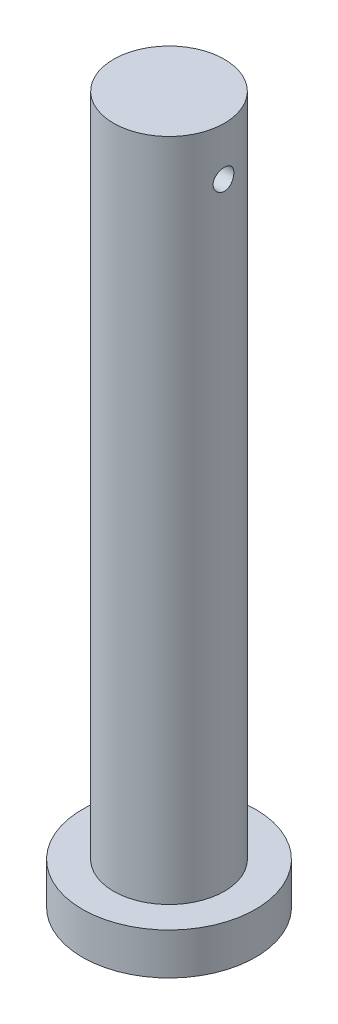
ISO-10303-21;
HEADER;
FILE_DESCRIPTION(('STEP AP214'),'2;1');
FILE_NAME('part.step','',(''),(''),'','','');
FILE_SCHEMA(('AUTOMOTIVE_DESIGN { 1 0 10303 214 1 1 1 1 }'));
ENDSEC;
DATA;
#1=APPLICATION_CONTEXT('core data for automotive mechanical design processes');
#2=APPLICATION_PROTOCOL_DEFINITION('international standard','automotive_design',2000,#1);
#3=PRODUCT_CONTEXT('',#1,'mechanical');
#4=PRODUCT('Part','Part','',(#3));
#5=PRODUCT_RELATED_PRODUCT_CATEGORY('part','',(#4));
#6=PRODUCT_DEFINITION_FORMATION('','',#4);
#7=PRODUCT_DEFINITION_CONTEXT('part definition',#1,'design');
#8=PRODUCT_DEFINITION('design','',#6,#7);
#9=PRODUCT_DEFINITION_SHAPE('','',#8);
#10=(LENGTH_UNIT() NAMED_UNIT(*) SI_UNIT(.MILLI.,.METRE.));
#11=(NAMED_UNIT(*) PLANE_ANGLE_UNIT() SI_UNIT($,.RADIAN.));
#12=(NAMED_UNIT(*) SI_UNIT($,.STERADIAN.) SOLID_ANGLE_UNIT());
#13=UNCERTAINTY_MEASURE_WITH_UNIT(LENGTH_MEASURE(1.E-05),#10,'distance_accuracy_value','');
#14=(GEOMETRIC_REPRESENTATION_CONTEXT(3) GLOBAL_UNCERTAINTY_ASSIGNED_CONTEXT((#13)) GLOBAL_UNIT_ASSIGNED_CONTEXT((#10,
#11,#12)) REPRESENTATION_CONTEXT('',''));
#15=CARTESIAN_POINT('',(0.,0.,0.));
#16=DIRECTION('',(0.,0.,1.));
#17=DIRECTION('',(1.,0.,0.));
#18=AXIS2_PLACEMENT_3D('',#15,#16,#17);
#19=CARTESIAN_POINT('',(2.41946524128127E-08,-38.0053737553816,9.76190137910418E-08));
#20=DIRECTION('',(0.,-1.,0.));
#21=DIRECTION('',(0.,0.,-1.));
#22=AXIS2_PLACEMENT_3D('',#19,#20,#21);
#23=CYLINDRICAL_SURFACE('',#22,25.);
#24=CARTESIAN_POINT('',(2.41946524128127E-08,-38.0053737553816,9.76190137910418E-08));
#25=DIRECTION('',(0.,1.,0.));
#26=DIRECTION('',(0.,0.,1.));
#27=AXIS2_PLACEMENT_3D('',#24,#25,#26);
#28=CIRCLE('',#27,25.);
#29=CARTESIAN_POINT('',(2.41946524128127E-08,-38.0053737553816,25.000000097619));
#30=VERTEX_POINT('',#29);
#31=EDGE_CURVE('E59',#30,#30,#28,.T.);
#32=ORIENTED_EDGE('',*,*,#31,.F.);
#33=EDGE_LOOP('',(#32));
#34=FACE_BOUND('',#33,.T.);
#35=CARTESIAN_POINT('',(2.41946524128127E-08,-50.0053737553816,9.76190137910418E-08));
#36=DIRECTION('',(0.,1.,0.));
#37=DIRECTION('',(0.,0.,1.));
#38=AXIS2_PLACEMENT_3D('',#35,#36,#37);
#39=CIRCLE('',#38,25.);
#40=CARTESIAN_POINT('',(2.41946524128127E-08,-50.0053737553816,25.000000097619));
#41=VERTEX_POINT('',#40);
#42=EDGE_CURVE('E64',#41,#41,#39,.T.);
#43=ORIENTED_EDGE('',*,*,#42,.T.);
#44=EDGE_LOOP('',(#43));
#45=FACE_BOUND('',#44,.T.);
#46=ADVANCED_FACE('F47',(#34,#45),#23,.T.);
#47=CARTESIAN_POINT('',(2.41946524128127E-08,-38.0053737553816,9.76190137910418E-08));
#48=DIRECTION('',(0.,1.,0.));
#49=DIRECTION('',(0.,0.,1.));
#50=AXIS2_PLACEMENT_3D('',#47,#48,#49);
#51=PLANE('',#50);
#52=CARTESIAN_POINT('',(2.41946524128127E-08,-38.0053737553816,9.76190137910418E-08));
#53=DIRECTION('',(0.,1.,0.));
#54=DIRECTION('',(0.,0.,1.));
#55=AXIS2_PLACEMENT_3D('',#52,#53,#54);
#56=CIRCLE('',#55,16.);
#57=CARTESIAN_POINT('',(2.41946524128127E-08,-38.0053737553816,16.000000097619));
#58=VERTEX_POINT('',#57);
#59=EDGE_CURVE('E10',#58,#58,#56,.T.);
#60=ORIENTED_EDGE('',*,*,#59,.F.);
#61=EDGE_LOOP('',(#60));
#62=FACE_BOUND('',#61,.T.);
#63=ORIENTED_EDGE('',*,*,#31,.T.);
#64=EDGE_LOOP('',(#63));
#65=FACE_BOUND('',#64,.T.);
#66=ADVANCED_FACE('F94',(#62,#65),#51,.T.);
#67=CARTESIAN_POINT('',(2.41946524128127E-08,-50.0053737553816,9.76190137910418E-08));
#68=DIRECTION('',(0.,1.,0.));
#69=DIRECTION('',(0.,0.,1.));
#70=AXIS2_PLACEMENT_3D('',#67,#68,#69);
#71=PLANE('',#70);
#72=ORIENTED_EDGE('',*,*,#42,.F.);
#73=EDGE_LOOP('',(#72));
#74=FACE_BOUND('',#73,.T.);
#75=ADVANCED_FACE('F90',(#74),#71,.F.);
#76=CARTESIAN_POINT('',(2.41946524128127E-08,153.994626244618,9.76190137910418E-08));
#77=DIRECTION('',(0.,-1.,0.));
#78=DIRECTION('',(0.,0.,-1.));
#79=AXIS2_PLACEMENT_3D('',#76,#77,#78);
#80=CYLINDRICAL_SURFACE('',#79,16.);
#81=CARTESIAN_POINT('',(-15.7162336213071,139.994626244618,-2.99999990238099));
#82=CARTESIAN_POINT('',(-15.7162368517067,140.161540660644,-2.99999350004687));
#83=CARTESIAN_POINT('',(-15.7189215710191,140.328538141056,-2.98602242935996));
#84=CARTESIAN_POINT('',(-15.7293569960842,140.657824167782,-2.93054496741683));
#85=CARTESIAN_POINT('',(-15.7371119992672,140.820108597473,-2.88901521775045));
#86=CARTESIAN_POINT('',(-15.7567795051053,141.13515638736,-2.77974061473681));
#87=CARTESIAN_POINT('',(-15.7686881339259,141.287928463233,-2.7120201814685));
#88=CARTESIAN_POINT('',(-15.7953165022239,141.579933363192,-2.5523512175883));
#89=CARTESIAN_POINT('',(-15.8100360223176,141.719167242625,-2.46040457756485));
#90=CARTESIAN_POINT('',(-15.8408322725844,141.981886643017,-2.25367348123344));
#91=CARTESIAN_POINT('',(-15.856922308319,142.105179211562,-2.13864576104283));
#92=CARTESIAN_POINT('',(-15.888529129086,142.330835023818,-1.88954345998809));
#93=CARTESIAN_POINT('',(-15.9040458764284,142.433196893468,-1.75546762963088));
#94=CARTESIAN_POINT('',(-15.9329003323735,142.614824997819,-1.47080769152131));
#95=CARTESIAN_POINT('',(-15.9462205368526,142.693909311657,-1.32010558244871));
#96=CARTESIAN_POINT('',(-15.969032148464,142.825565329166,-1.0072624688825));
#97=CARTESIAN_POINT('',(-15.978523870372,142.878139212599,-0.845122406099986));
#98=CARTESIAN_POINT('',(-15.9925150782809,142.954685341841,-0.51600539475581));
#99=CARTESIAN_POINT('',(-15.9970712953319,142.978982856464,-0.349106548870696));
#100=CARTESIAN_POINT('',(-16.0008736681172,142.999300020019,-0.0135432544517544));
#101=CARTESIAN_POINT('',(-16.0001202760193,142.995322076897,0.155121042514349));
#102=CARTESIAN_POINT('',(-15.9934326510702,142.959450702324,0.487196813417803));
#103=CARTESIAN_POINT('',(-15.9875634207496,142.927907505758,0.650647618521952));
#104=CARTESIAN_POINT('',(-15.9713765024766,142.838354945828,0.969894429049965));
#105=CARTESIAN_POINT('',(-15.9610586524047,142.780344617927,1.12569015527209));
#106=CARTESIAN_POINT('',(-15.9370251817521,142.639170782502,1.42622022912206));
#107=CARTESIAN_POINT('',(-15.9232907276219,142.555867268793,1.57088724129609));
#108=CARTESIAN_POINT('',(-15.8939429266623,142.366574906464,1.8443200520483));
#109=CARTESIAN_POINT('',(-15.8783293888286,142.260583750843,1.97308423144058));
#110=CARTESIAN_POINT('',(-15.8466702494167,142.026994838651,2.21313133555709));
#111=CARTESIAN_POINT('',(-15.8306216938378,141.899090676814,2.32411591275984));
#112=CARTESIAN_POINT('',(-15.8001301542978,141.626327182061,2.52310353464423));
#113=CARTESIAN_POINT('',(-15.7856871938324,141.481467601089,2.61110624304266));
#114=CARTESIAN_POINT('',(-15.7600378419478,141.178509703213,2.76171714210856));
#115=CARTESIAN_POINT('',(-15.7488369864106,141.020389330237,2.82428197052744));
#116=CARTESIAN_POINT('',(-15.7310248237391,140.695623876372,2.92187323712014));
#117=CARTESIAN_POINT('',(-15.7244129965777,140.528979763689,2.95690279564118));
#118=CARTESIAN_POINT('',(-15.7166303818255,140.194587586907,2.9979935506138));
#119=CARTESIAN_POINT('',(-15.7153790921281,140.026894013487,3.00448338333619));
#120=CARTESIAN_POINT('',(-15.7182438042221,139.692819334444,2.9894594752535));
#121=CARTESIAN_POINT('',(-15.7223595405776,139.526438164322,2.96794711934768));
#122=CARTESIAN_POINT('',(-15.7354195770695,139.20112043851,2.89789746153667));
#123=CARTESIAN_POINT('',(-15.7443237096229,139.042133739369,2.8495848692988));
#124=CARTESIAN_POINT('',(-15.7659226589377,138.734511865158,2.72754458520021));
#125=CARTESIAN_POINT('',(-15.778617755071,138.585877453988,2.65381502019491));
#126=CARTESIAN_POINT('',(-15.806551533079,138.301291006532,2.48204716001221));
#127=CARTESIAN_POINT('',(-15.8218178843117,138.165505168886,2.38373809041143));
#128=CARTESIAN_POINT('',(-15.8530962031674,137.91220216419,2.16596698450394));
#129=CARTESIAN_POINT('',(-15.8691082377352,137.794686641507,2.04650304628068));
#130=CARTESIAN_POINT('',(-15.9003324559243,137.57965871755,1.78789893335979));
#131=CARTESIAN_POINT('',(-15.9155310924714,137.482434591407,1.6485171658108));
#132=CARTESIAN_POINT('',(-15.9431880720124,137.312783832263,1.3551491436993));
#133=CARTESIAN_POINT('',(-15.9556465204999,137.240356244568,1.20116345169607));
#134=CARTESIAN_POINT('',(-15.9763611357223,137.12278604889,0.883755180776382));
#135=CARTESIAN_POINT('',(-15.9846390704081,137.077501869496,0.720386523776991));
#136=CARTESIAN_POINT('',(-15.9961528174803,137.015052148039,0.388192552382156));
#137=CARTESIAN_POINT('',(-15.9993891604042,136.997883647293,0.219367814050714));
#138=CARTESIAN_POINT('',(-16.000444526114,136.992255641582,-0.116181422881991));
#139=CARTESIAN_POINT('',(-15.9983457083054,137.003360738359,-0.282898516513492));
#140=CARTESIAN_POINT('',(-15.98913730804,137.053011100155,-0.612046640939401));
#141=CARTESIAN_POINT('',(-15.9820277736211,137.091556102107,-0.774477712808445));
#142=CARTESIAN_POINT('',(-15.9635967353639,137.194808659386,-1.09021285357187));
#143=CARTESIAN_POINT('',(-15.9522826954282,137.25946987038,-1.24353254101712));
#144=CARTESIAN_POINT('',(-15.9266674171894,137.413067151929,-1.53721116501468));
#145=CARTESIAN_POINT('',(-15.9123659787673,137.502004848834,-1.67756923238868));
#146=CARTESIAN_POINT('',(-15.8820955729714,137.703129153501,-1.94350995793983));
#147=CARTESIAN_POINT('',(-15.8661056675076,137.815630312334,-2.06885237315764));
#148=CARTESIAN_POINT('',(-15.8343926467052,138.060035369612,-2.29903062369507));
#149=CARTESIAN_POINT('',(-15.8186695950006,138.191943825397,-2.403861628893));
#150=CARTESIAN_POINT('',(-15.7891115238591,138.472879153999,-2.59095258127506));
#151=CARTESIAN_POINT('',(-15.7752953196789,138.622053123847,-2.67299471296147));
#152=CARTESIAN_POINT('',(-15.7513416671038,138.932277824471,-2.8107225507925));
#153=CARTESIAN_POINT('',(-15.7412007483981,139.093317177769,-2.86643313514561));
#154=CARTESIAN_POINT('',(-15.7278603019325,139.378130820766,-2.93859443431329));
#155=CARTESIAN_POINT('',(-15.723526190241,139.500237692147,-2.96158201718038));
#156=CARTESIAN_POINT('',(-15.7177116876384,139.746423181455,-2.99228692390291));
#157=CARTESIAN_POINT('',(-15.7162312190476,139.870501745618,-3.0000046634228));
#158=CARTESIAN_POINT('',(-15.7162336213071,139.994626244618,-2.99999990238099));
#159=B_SPLINE_CURVE_WITH_KNOTS('',3,(#81,#82,#83,#84,#85,#86,#87,#88,#89,#90,#91,#92,#93,#94,
#95,#96,#97,#98,#99,#100,#101,#102,#103,#104,#105,#106,#107,#108,#109,#110,#111,#112,#113,#114,
#115,#116,#117,#118,#119,#120,#121,#122,#123,#124,#125,#126,#127,#128,#129,#130,#131,#132,#133,
#134,#135,#136,#137,#138,#139,#140,#141,#142,#143,#144,#145,#146,#147,#148,#149,#150,#151,#152,
#153,#154,#155,#156,#157,#158),.UNSPECIFIED.,.T.,.F.,(4,2,2,2,2,2,2,2,2,2,2,2,2,2,2,2,2,2,2,2,2,
2,2,2,2,2,2,2,2,2,2,2,2,2,2,2,2,2,4),(0.,0.500289011586391,1.00100260476078,1.50125045595684,
2.00145927987813,2.50724671397381,3.0130673413863,3.52274208696096,4.03237491879282,
4.53608550920522,5.03975320401296,5.53711301197449,6.03449094656848,6.53467383968438,
7.03490761823573,7.5428122952813,8.05072440384802,8.55949872236534,9.06821537732976,
9.5692649717415,10.0702897867744,10.5671758463074,11.0640985324864,11.5667572530829,
12.0694611878935,12.5788825099174,13.0882842164341,13.5950053883737,14.1016732333466,
14.6005860114027,15.0994940064433,15.5975205306071,16.0955804271422,16.6007692801749,
17.1060769546153,17.6160600363782,18.1255603150176,18.4976061505795,18.8696418584437),.UNSPECIFIED.);
#160=CARTESIAN_POINT('',(-15.7162336213071,139.994626244618,-2.99999990238099));
#161=VERTEX_POINT('',#160);
#162=EDGE_CURVE('E50',#161,#161,#159,.T.);
#163=ORIENTED_EDGE('',*,*,#162,.T.);
#164=EDGE_LOOP('',(#163));
#165=FACE_BOUND('',#164,.T.);
#166=CARTESIAN_POINT('',(15.7162336696964,139.994626244618,-2.99999990238099));
#167=CARTESIAN_POINT('',(15.716236900096,139.827711828593,-2.99999350004687));
#168=CARTESIAN_POINT('',(15.7189216194084,139.660714348181,-2.98602242935996));
#169=CARTESIAN_POINT('',(15.7293570444735,139.331428321455,-2.93054496741683));
#170=CARTESIAN_POINT('',(15.7371120476565,139.169143891764,-2.88901521775046));
#171=CARTESIAN_POINT('',(15.7567795534946,138.854096101877,-2.77974061473681));
#172=CARTESIAN_POINT('',(15.7686881823152,138.701324026004,-2.71202018146847));
#173=CARTESIAN_POINT('',(15.7953165506132,138.409319126045,-2.55235121758828));
#174=CARTESIAN_POINT('',(15.8100360707069,138.270085246612,-2.46040457756486));
#175=CARTESIAN_POINT('',(15.8408323209737,138.00736584622,-2.25367348123345));
#176=CARTESIAN_POINT('',(15.8569223567083,137.884073277675,-2.13864576104282));
#177=CARTESIAN_POINT('',(15.8885291774753,137.658417465419,-1.88954345998807));
#178=CARTESIAN_POINT('',(15.9040459248177,137.556055595769,-1.75546762963087));
#179=CARTESIAN_POINT('',(15.9329003807628,137.374427491417,-1.47080769152131));
#180=CARTESIAN_POINT('',(15.9462205852419,137.29534317758,-1.32010558244871));
#181=CARTESIAN_POINT('',(15.9690321968533,137.163687160071,-1.0072624688825));
#182=CARTESIAN_POINT('',(15.9785239187613,137.111113276638,-0.845122406099984));
#183=CARTESIAN_POINT('',(15.9925151266702,137.034567147396,-0.516005394755809));
#184=CARTESIAN_POINT('',(15.9970713437212,137.010269632773,-0.349106548870693));
#185=CARTESIAN_POINT('',(16.0008737165065,136.989952469218,-0.0135432544517503));
#186=CARTESIAN_POINT('',(16.0001203244086,136.99393041234,0.155121042514354));
#187=CARTESIAN_POINT('',(15.9934326994595,137.029801786913,0.487196813417801));
#188=CARTESIAN_POINT('',(15.9875634691389,137.061344983478,0.650647618521944));
#189=CARTESIAN_POINT('',(15.9713765508659,137.150897543409,0.969894429049958));
#190=CARTESIAN_POINT('',(15.961058700794,137.20890787131,1.12569015527209));
#191=CARTESIAN_POINT('',(15.9370252301414,137.350081706735,1.42622022912205));
#192=CARTESIAN_POINT('',(15.9232907760112,137.433385220443,1.57088724129607));
#193=CARTESIAN_POINT('',(15.8939429750516,137.622677582773,1.84432005204828));
#194=CARTESIAN_POINT('',(15.8783294372179,137.728668738394,1.97308423144059));
#195=CARTESIAN_POINT('',(15.846670297806,137.962257650585,2.21313133555709));
#196=CARTESIAN_POINT('',(15.8306217422271,138.090161812423,2.32411591275983));
#197=CARTESIAN_POINT('',(15.8001302026871,138.362925307176,2.52310353464422));
#198=CARTESIAN_POINT('',(15.7856872422217,138.507784888148,2.61110624304266));
#199=CARTESIAN_POINT('',(15.7600378903371,138.810742786024,2.76171714210856));
#200=CARTESIAN_POINT('',(15.7488370347999,138.968863159,2.82428197052743));
#201=CARTESIAN_POINT('',(15.7310248721284,139.293628612865,2.92187323712012));
#202=CARTESIAN_POINT('',(15.724413044967,139.460272725548,2.95690279564117));
#203=CARTESIAN_POINT('',(15.7166304302148,139.79466490233,2.9979935506138));
#204=CARTESIAN_POINT('',(15.7153791405174,139.962358475749,3.00448338333619));
#205=CARTESIAN_POINT('',(15.7182438526115,140.296433154793,2.98945947525351));
#206=CARTESIAN_POINT('',(15.7223595889669,140.462814324915,2.96794711934768));
#207=CARTESIAN_POINT('',(15.7354196254588,140.788132050727,2.89789746153667));
#208=CARTESIAN_POINT('',(15.7443237580122,140.947118749868,2.8495848692988));
#209=CARTESIAN_POINT('',(15.765922707327,141.254740624079,2.72754458520021));
#210=CARTESIAN_POINT('',(15.7786178034603,141.403375035249,2.65381502019491));
#211=CARTESIAN_POINT('',(15.8065515814684,141.687961482705,2.48204716001221));
#212=CARTESIAN_POINT('',(15.821817932701,141.823747320351,2.38373809041142));
#213=CARTESIAN_POINT('',(15.8530962515567,142.077050325047,2.16596698450394));
#214=CARTESIAN_POINT('',(15.8691082861245,142.19456584773,2.04650304628069));
#215=CARTESIAN_POINT('',(15.9003325043136,142.409593771687,1.78789893335979));
#216=CARTESIAN_POINT('',(15.9155311408607,142.50681789783,1.6485171658108));
#217=CARTESIAN_POINT('',(15.9431881204017,142.676468656974,1.3551491436993));
#218=CARTESIAN_POINT('',(15.9556465688892,142.748896244668,1.20116345169607));
#219=CARTESIAN_POINT('',(15.9763611841116,142.866466440347,0.883755180776384));
#220=CARTESIAN_POINT('',(15.9846391187974,142.911750619741,0.720386523776991));
#221=CARTESIAN_POINT('',(15.9961528658696,142.974200341198,0.388192552382155));
#222=CARTESIAN_POINT('',(15.9993892087935,142.991368841944,0.219367814050715));
#223=CARTESIAN_POINT('',(16.0004445745033,142.996996847655,-0.116181422881994));
#224=CARTESIAN_POINT('',(15.9983457566947,142.985891750878,-0.2828985165135));
#225=CARTESIAN_POINT('',(15.9891373564293,142.936241389082,-0.612046640939406));
#226=CARTESIAN_POINT('',(15.9820278220104,142.89769638713,-0.774477712808441));
#227=CARTESIAN_POINT('',(15.9635967837532,142.794443829851,-1.09021285357187));
#228=CARTESIAN_POINT('',(15.9522827438175,142.729782618857,-1.24353254101714));
#229=CARTESIAN_POINT('',(15.9266674655787,142.576185337308,-1.53721116501469));
#230=CARTESIAN_POINT('',(15.9123660271566,142.487247640403,-1.67756923238868));
#231=CARTESIAN_POINT('',(15.8820956213607,142.286123335736,-1.94350995793983));
#232=CARTESIAN_POINT('',(15.8661057158969,142.173622176903,-2.06885237315767));
#233=CARTESIAN_POINT('',(15.8343926950945,141.929217119625,-2.2990306236951));
#234=CARTESIAN_POINT('',(15.8186696433899,141.79730866384,-2.403861628893));
#235=CARTESIAN_POINT('',(15.7891115722484,141.516373335238,-2.59095258127504));
#236=CARTESIAN_POINT('',(15.7752953680682,141.36719936539,-2.67299471296147));
#237=CARTESIAN_POINT('',(15.7513417154931,141.056974664766,-2.81072255079251));
#238=CARTESIAN_POINT('',(15.7412007967874,140.895935311468,-2.86643313514561));
#239=CARTESIAN_POINT('',(15.7278603503218,140.611121668471,-2.93859443431329));
#240=CARTESIAN_POINT('',(15.7235262386303,140.48901479709,-2.96158201718038));
#241=CARTESIAN_POINT('',(15.7177117360277,140.242829307782,-2.99228692390291));
#242=CARTESIAN_POINT('',(15.7162312674369,140.118750743619,-3.0000046634228));
#243=CARTESIAN_POINT('',(15.7162336696964,139.994626244618,-2.99999990238099));
#244=B_SPLINE_CURVE_WITH_KNOTS('',3,(#166,#167,#168,#169,#170,#171,#172,#173,#174,#175,#176,
#177,#178,#179,#180,#181,#182,#183,#184,#185,#186,#187,#188,#189,#190,#191,#192,#193,#194,#195,
#196,#197,#198,#199,#200,#201,#202,#203,#204,#205,#206,#207,#208,#209,#210,#211,#212,#213,#214,
#215,#216,#217,#218,#219,#220,#221,#222,#223,#224,#225,#226,#227,#228,#229,#230,#231,#232,#233,
#234,#235,#236,#237,#238,#239,#240,#241,#242,#243),.UNSPECIFIED.,.T.,.F.,(4,2,2,2,2,2,2,2,2,2,2,
2,2,2,2,2,2,2,2,2,2,2,2,2,2,2,2,2,2,2,2,2,2,2,2,2,2,2,4),(0.,0.500289011586391,1.00100260476078,
1.50125045595687,2.00145927987817,2.50724671397382,3.01306734138631,3.52274208696097,
4.03237491879282,4.53608550920523,5.03975320401296,5.53711301197449,6.03449094656849,
6.53467383968438,7.03490761823571,7.54281229528128,8.05072440384799,8.5594987223653,
9.06821537732973,9.56926497174147,10.0702897867744,10.5671758463074,11.0640985324864,
11.5667572530829,12.0694611878935,12.5788825099174,13.0882842164341,13.5950053883737,
14.1016732333466,14.6005860114028,15.0994940064434,15.5975205306072,16.0955804271422,
16.6007692801749,17.1060769546153,17.6160600363782,18.1255603150176,18.4976061505795,
18.8696418584437),.UNSPECIFIED.);
#245=CARTESIAN_POINT('',(15.7162336696964,139.994626244618,-2.99999990238099));
#246=VERTEX_POINT('',#245);
#247=EDGE_CURVE('E70',#246,#246,#244,.T.);
#248=ORIENTED_EDGE('',*,*,#247,.T.);
#249=EDGE_LOOP('',(#248));
#250=FACE_BOUND('',#249,.T.);
#251=CARTESIAN_POINT('',(2.41946524128127E-08,153.994626244618,9.76190137910418E-08));
#252=DIRECTION('',(0.,1.,0.));
#253=DIRECTION('',(0.,0.,1.));
#254=AXIS2_PLACEMENT_3D('',#251,#252,#253);
#255=CIRCLE('',#254,16.);
#256=CARTESIAN_POINT('',(2.41946524128127E-08,153.994626244618,16.000000097619));
#257=VERTEX_POINT('',#256);
#258=EDGE_CURVE('E67',#257,#257,#255,.T.);
#259=ORIENTED_EDGE('',*,*,#258,.F.);
#260=EDGE_LOOP('',(#259));
#261=FACE_BOUND('',#260,.T.);
#262=ORIENTED_EDGE('',*,*,#59,.T.);
#263=EDGE_LOOP('',(#262));
#264=FACE_BOUND('',#263,.T.);
#265=ADVANCED_FACE('F75',(#165,#250,#261,#264),#80,.T.);
#266=CARTESIAN_POINT('',(2.41946524128127E-08,153.994626244618,9.76190137910418E-08));
#267=DIRECTION('',(0.,1.,0.));
#268=DIRECTION('',(0.,0.,1.));
#269=AXIS2_PLACEMENT_3D('',#266,#267,#268);
#270=PLANE('',#269);
#271=ORIENTED_EDGE('',*,*,#258,.T.);
#272=EDGE_LOOP('',(#271));
#273=FACE_BOUND('',#272,.T.);
#274=ADVANCED_FACE('F82',(#273),#270,.T.);
#275=CARTESIAN_POINT('',(-24.9999999758053,139.994626244618,9.76190137910418E-08));
#276=DIRECTION('',(1.,0.,0.));
#277=DIRECTION('',(0.,0.,-1.));
#278=AXIS2_PLACEMENT_3D('',#275,#276,#277);
#279=CYLINDRICAL_SURFACE('',#278,3.);
#280=ORIENTED_EDGE('',*,*,#247,.F.);
#281=EDGE_LOOP('',(#280));
#282=FACE_BOUND('',#281,.T.);
#283=ORIENTED_EDGE('',*,*,#162,.F.);
#284=EDGE_LOOP('',(#283));
#285=FACE_BOUND('',#284,.T.);
#286=ADVANCED_FACE('F79',(#282,#285),#279,.F.);
#287=CLOSED_SHELL('',(#46,#66,#75,#265,#274,#286));
#288=MANIFOLD_SOLID_BREP('B2',#287);
#289=ADVANCED_BREP_SHAPE_REPRESENTATION('',(#18,#288),#14);
#290=SHAPE_DEFINITION_REPRESENTATION(#9,#289);
ENDSEC;
END-ISO-10303-21;
